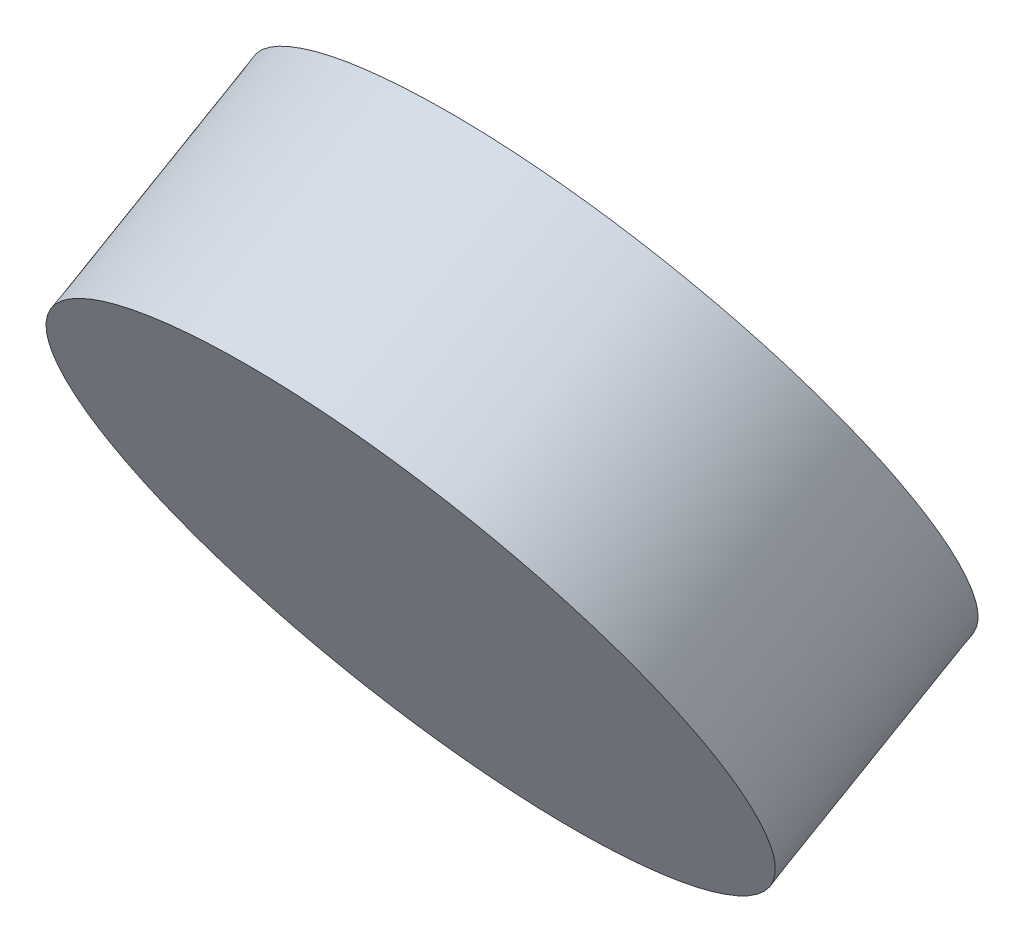
ISO-10303-21;
HEADER;
FILE_DESCRIPTION(('STEP AP214'),'2;1');
FILE_NAME('part.step','',(''),(''),'','','');
FILE_SCHEMA(('AUTOMOTIVE_DESIGN { 1 0 10303 214 1 1 1 1 }'));
ENDSEC;
DATA;
#1=APPLICATION_CONTEXT('core data for automotive mechanical design processes');
#2=APPLICATION_PROTOCOL_DEFINITION('international standard','automotive_design',2000,#1);
#3=PRODUCT_CONTEXT('',#1,'mechanical');
#4=PRODUCT('Part','Part','',(#3));
#5=PRODUCT_RELATED_PRODUCT_CATEGORY('part','',(#4));
#6=PRODUCT_DEFINITION_FORMATION('','',#4);
#7=PRODUCT_DEFINITION_CONTEXT('part definition',#1,'design');
#8=PRODUCT_DEFINITION('design','',#6,#7);
#9=PRODUCT_DEFINITION_SHAPE('','',#8);
#10=(LENGTH_UNIT() NAMED_UNIT(*) SI_UNIT(.MILLI.,.METRE.));
#11=(NAMED_UNIT(*) PLANE_ANGLE_UNIT() SI_UNIT($,.RADIAN.));
#12=(NAMED_UNIT(*) SI_UNIT($,.STERADIAN.) SOLID_ANGLE_UNIT());
#13=UNCERTAINTY_MEASURE_WITH_UNIT(LENGTH_MEASURE(1.E-05),#10,'distance_accuracy_value','');
#14=(GEOMETRIC_REPRESENTATION_CONTEXT(3) GLOBAL_UNCERTAINTY_ASSIGNED_CONTEXT((#13)) GLOBAL_UNIT_ASSIGNED_CONTEXT((#10,
#11,#12)) REPRESENTATION_CONTEXT('',''));
#15=CARTESIAN_POINT('',(0.,0.,0.));
#16=DIRECTION('',(0.,0.,1.));
#17=DIRECTION('',(1.,0.,0.));
#18=AXIS2_PLACEMENT_3D('',#15,#16,#17);
#19=CARTESIAN_POINT('',(12.5,12.8769058027011,-40.1476192479979));
#20=CARTESIAN_POINT('',(12.6682299792076,12.8769058027011,-40.1476192479979));
#21=CARTESIAN_POINT('',(13.0046899376229,12.8189461459482,-40.1810822714263));
#22=CARTESIAN_POINT('',(13.4325454072684,12.5713634390628,-40.3240242138933));
#23=CARTESIAN_POINT('',(13.7184292922025,12.2008297332016,-40.5379519487161));
#24=CARTESIAN_POINT('',(13.8188183624877,11.7637554261858,-40.7902969175275));
#25=CARTESIAN_POINT('',(13.7184292922025,11.32668111917,-41.042641886339));
#26=CARTESIAN_POINT('',(13.4325454072684,10.9561474133088,-41.2565696211617));
#27=CARTESIAN_POINT('',(13.0046899376229,10.7085647064234,-41.3995115636288));
#28=CARTESIAN_POINT('',(12.5,10.621625221294,-41.4497060987714));
#29=CARTESIAN_POINT('',(11.9953100623771,10.7085647064234,-41.3995115636288));
#30=CARTESIAN_POINT('',(11.5674545927316,10.9561474133088,-41.2565696211617));
#31=CARTESIAN_POINT('',(11.2815707077975,11.32668111917,-41.042641886339));
#32=CARTESIAN_POINT('',(11.1811816375123,11.7637554261858,-40.7902969175275));
#33=CARTESIAN_POINT('',(11.2815707077975,12.2008297332016,-40.5379519487161));
#34=CARTESIAN_POINT('',(11.5674545927316,12.5713634390628,-40.3240242138933));
#35=CARTESIAN_POINT('',(11.9953100623771,12.8189461459482,-40.1810822714263));
#36=CARTESIAN_POINT('',(12.3317700207924,12.8769058027011,-40.1476192479979));
#37=CARTESIAN_POINT('',(12.5,12.8769058027011,-40.1476192479979));
#38=B_SPLINE_CURVE_WITH_KNOTS('',3,(#19,#20,#21,#22,#23,#24,#25,#26,#27,#28,#29,#30,#31,#32,#33,
#34,#35,#36,#37),.UNSPECIFIED.,.T.,.F.,(4,1,1,1,1,1,1,1,1,1,1,1,1,1,1,1,4),(0.,
0.0624999999999998,0.124999999999999,0.1875,0.25,0.3125,0.374999999999999,0.4375,
0.499999999999999,0.562499999999999,0.625,0.687499999999999,0.749999999999999,0.812499999999999,
0.874999999999999,0.9375,1.),.UNSPECIFIED.);
#39=DIRECTION('',(0.,0.499999999999995,-0.866025403784442));
#40=VECTOR('',#39,1.);
#41=SURFACE_OF_LINEAR_EXTRUSION('',#38,#40);
#42=CARTESIAN_POINT('',(12.5,12.8769058027011,-40.1476192479979));
#43=CARTESIAN_POINT('',(12.6682299792076,12.8769058027011,-40.1476192479979));
#44=CARTESIAN_POINT('',(13.0046899376229,12.8189461459482,-40.1810822714263));
#45=CARTESIAN_POINT('',(13.4325454072684,12.5713634390628,-40.3240242138933));
#46=CARTESIAN_POINT('',(13.7184292922025,12.2008297332016,-40.5379519487161));
#47=CARTESIAN_POINT('',(13.8188183624877,11.7637554261858,-40.7902969175275));
#48=CARTESIAN_POINT('',(13.7184292922025,11.32668111917,-41.042641886339));
#49=CARTESIAN_POINT('',(13.4325454072684,10.9561474133088,-41.2565696211617));
#50=CARTESIAN_POINT('',(13.0046899376229,10.7085647064234,-41.3995115636288));
#51=CARTESIAN_POINT('',(12.5,10.621625221294,-41.4497060987714));
#52=CARTESIAN_POINT('',(11.9953100623771,10.7085647064234,-41.3995115636288));
#53=CARTESIAN_POINT('',(11.5674545927316,10.9561474133088,-41.2565696211618));
#54=CARTESIAN_POINT('',(11.2815707077975,11.32668111917,-41.042641886339));
#55=CARTESIAN_POINT('',(11.1811816375123,11.7637554261858,-40.7902969175275));
#56=CARTESIAN_POINT('',(11.2815707077975,12.2008297332016,-40.5379519487161));
#57=CARTESIAN_POINT('',(11.5674545927316,12.5713634390628,-40.3240242138933));
#58=CARTESIAN_POINT('',(11.9953100623771,12.8189461459482,-40.1810822714263));
#59=CARTESIAN_POINT('',(12.3317700207924,12.8769058027011,-40.1476192479979));
#60=CARTESIAN_POINT('',(12.5,12.8769058027011,-40.1476192479979));
#61=B_SPLINE_CURVE_WITH_KNOTS('',3,(#42,#43,#44,#45,#46,#47,#48,#49,#50,#51,#52,#53,#54,#55,#56,
#57,#58,#59,#60),.UNSPECIFIED.,.T.,.F.,(4,1,1,1,1,1,1,1,1,1,1,1,1,1,1,1,4),(0.,
0.0624999999999998,0.124999999999999,0.1875,0.25,0.3125,0.374999999999999,0.4375,
0.499999999999999,0.562499999999999,0.625,0.687499999999999,0.749999999999999,0.812499999999999,
0.874999999999999,0.9375,1.),.UNSPECIFIED.);
#62=CARTESIAN_POINT('',(12.5,12.8769058027011,-40.1476192479979));
#63=VERTEX_POINT('',#62);
#64=EDGE_CURVE('E10',#63,#63,#61,.T.);
#65=ORIENTED_EDGE('',*,*,#64,.T.);
#66=EDGE_LOOP('',(#65));
#67=FACE_BOUND('',#66,.T.);
#68=CARTESIAN_POINT('',(12.5,13.3379679238206,-40.9462022672223));
#69=CARTESIAN_POINT('',(12.4802078293791,13.3379679358702,-40.9462022602654));
#70=CARTESIAN_POINT('',(12.4604160064381,13.3375668035859,-40.9464338540977));
#71=CARTESIAN_POINT('',(12.4208740611593,13.3359695558442,-40.9473560255114));
#72=CARTESIAN_POINT('',(12.4011239411206,13.3347733976489,-40.9480466277674));
#73=CARTESIAN_POINT('',(12.361707247751,13.3315933005748,-40.9498826576692));
#74=CARTESIAN_POINT('',(12.3420406800009,13.3296093098847,-40.9510281152282));
#75=CARTESIAN_POINT('',(12.3028326940438,13.3248607327772,-40.9537697074995));
#76=CARTESIAN_POINT('',(12.2832912817157,13.3220961099626,-40.9553658632257));
#77=CARTESIAN_POINT('',(12.2443752838696,13.3157934164188,-40.9590047250398));
#78=CARTESIAN_POINT('',(12.2250007000538,13.3122553378076,-40.9610474356784));
#79=CARTESIAN_POINT('',(12.1864600087902,13.3044129012575,-40.9655752685318));
#80=CARTESIAN_POINT('',(12.1672938951659,13.3001085660865,-40.9680603776014));
#81=CARTESIAN_POINT('',(12.1292118624428,13.2907406613577,-40.9734689399183));
#82=CARTESIAN_POINT('',(12.1102959285924,13.2856771367835,-40.9763923671942));
#83=CARTESIAN_POINT('',(12.0727557510285,13.2747983594353,-40.9826732322247));
#84=CARTESIAN_POINT('',(12.0541314885726,13.2689831551875,-40.9860306419625));
#85=CARTESIAN_POINT('',(12.0172169736989,13.2566068538541,-40.993176102869));
#86=CARTESIAN_POINT('',(11.9989267106994,13.2500457804469,-40.9969641403668));
#87=CARTESIAN_POINT('',(11.9627189991946,13.2361917156669,-41.0049627883969));
#88=CARTESIAN_POINT('',(11.9448015625403,13.2288987010709,-41.0091734123371));
#89=CARTESIAN_POINT('',(11.9093741638814,13.2136025883076,-41.0180046271586));
#90=CARTESIAN_POINT('',(11.8918642282456,13.2055994443496,-41.022625244477));
#91=CARTESIAN_POINT('',(11.8572873025821,13.1889031662712,-41.0322648451201));
#92=CARTESIAN_POINT('',(11.8402203388527,13.1802099913091,-41.0372838520246));
#93=CARTESIAN_POINT('',(11.8065646317142,13.1621541740291,-41.0477083829916));
#94=CARTESIAN_POINT('',(11.7899759025277,13.1527915118294,-41.0531139185329));
#95=CARTESIAN_POINT('',(11.7573120101872,13.1334171061409,-41.0642997368726));
#96=CARTESIAN_POINT('',(11.7412368418012,13.1234053692679,-41.0700800158513));
#97=CARTESIAN_POINT('',(11.7096354069979,13.1027532254237,-41.0820035366591));
#98=CARTESIAN_POINT('',(11.6941091150198,13.0921128477898,-41.0881467615503));
#99=CARTESIAN_POINT('',(11.6636407844299,13.0702238383473,-41.1007843870442));
#100=CARTESIAN_POINT('',(11.6486987074584,13.05897524659,-41.1072787645233));
#101=CARTESIAN_POINT('',(11.6194341116935,13.0358902035123,-41.1206069203585));
#102=CARTESIAN_POINT('',(11.6051115596369,13.0240537838265,-41.1274406804503));
#103=CARTESIAN_POINT('',(11.5771214873967,12.9998136702127,-41.1414357165704));
#104=CARTESIAN_POINT('',(11.5634539672131,12.9874099762847,-41.1485969925987));
#105=CARTESIAN_POINT('',(11.5367976555427,12.9620660929208,-41.1632292904811));
#106=CARTESIAN_POINT('',(11.5238089005846,12.9491258746782,-41.1707003289669));
#107=CARTESIAN_POINT('',(11.4985336495967,12.9227395263764,-41.1859344942618));
#108=CARTESIAN_POINT('',(11.4862471998143,12.9092933630968,-41.1936976402509));
#109=CARTESIAN_POINT('',(11.4624001581987,12.8819257177611,-41.2094983576525));
#110=CARTESIAN_POINT('',(11.4508396002413,12.8680042135687,-41.2175359418455));
#111=CARTESIAN_POINT('',(11.428467963562,12.8397164530154,-41.2338678880158));
#112=CARTESIAN_POINT('',(11.4176568924794,12.8253501921234,-41.242162252609));
#113=CARTESIAN_POINT('',(11.3968078305452,12.7962034947591,-41.2589901061783));
#114=CARTESIAN_POINT('',(11.3867698167363,12.781423070604,-41.2675235880429));
#115=CARTESIAN_POINT('',(11.3674906154502,12.7514785745946,-41.2848120508748));
#116=CARTESIAN_POINT('',(11.3582493808133,12.736314525515,-41.2935670186928));
#117=CARTESIAN_POINT('',(11.3405869511704,12.7056334982872,-41.3112807180219));
#118=CARTESIAN_POINT('',(11.3321657032899,12.6901165429747,-41.3202394363485));
#119=CARTESIAN_POINT('',(11.3161684072298,12.6587597449962,-41.3383432921023));
#120=CARTESIAN_POINT('',(11.3085923322345,12.6429199125933,-41.347488423604));
#121=CARTESIAN_POINT('',(11.2943014104208,12.6109510049536,-41.3659456810356));
#122=CARTESIAN_POINT('',(11.2875865909442,12.5948219205526,-41.3752578122562));
#123=CARTESIAN_POINT('',(11.275024860886,12.5623111730852,-41.3940279010581));
#124=CARTESIAN_POINT('',(11.2691780063378,12.5459294937874,-41.4034858680105));
#125=CARTESIAN_POINT('',(11.2583608816937,12.5129494861501,-41.4225268842977));
#126=CARTESIAN_POINT('',(11.2533906635404,12.4963511450355,-41.4321099410083));
#127=CARTESIAN_POINT('',(11.2443349978722,12.4629739268414,-41.4513802869175));
#128=CARTESIAN_POINT('',(11.2402495766475,12.446195044413,-41.4610675792042));
#129=CARTESIAN_POINT('',(11.2329718528758,12.4124928034574,-41.4805255770923));
#130=CARTESIAN_POINT('',(11.2297795412273,12.3955694464042,-41.4902962818425));
#131=CARTESIAN_POINT('',(11.2242963572203,12.361614327844,-41.5099002786836));
#132=CARTESIAN_POINT('',(11.2220054428337,12.3445825714288,-41.5197335678347));
#133=CARTESIAN_POINT('',(11.2183333810319,12.3104467386035,-41.5394419001054));
#134=CARTESIAN_POINT('',(11.2169521737904,12.2933426670238,-41.5493169404361));
#135=CARTESIAN_POINT('',(11.2151078384199,12.2590982447313,-41.569087966865));
#136=CARTESIAN_POINT('',(11.2146446609407,12.2419578960183,-41.5789839518084));
#137=CARTESIAN_POINT('',(11.2146446609407,12.2076771985922,-41.5987759216954));
#138=CARTESIAN_POINT('',(11.2151078384199,12.1905368498792,-41.6086719066389));
#139=CARTESIAN_POINT('',(11.2169521737904,12.1562924275867,-41.6284429330677));
#140=CARTESIAN_POINT('',(11.2183333810319,12.139188356007,-41.6383179733985));
#141=CARTESIAN_POINT('',(11.2220054428337,12.1050525231818,-41.6580263056691));
#142=CARTESIAN_POINT('',(11.2242963572203,12.0880207667665,-41.6678595948202));
#143=CARTESIAN_POINT('',(11.2297795412273,12.0540656482063,-41.6874635916613));
#144=CARTESIAN_POINT('',(11.2329718528758,12.0371422911531,-41.6972342964116));
#145=CARTESIAN_POINT('',(11.2402495766475,12.0034400501975,-41.7166922942996));
#146=CARTESIAN_POINT('',(11.2443349978722,11.9866611677691,-41.7263795865864));
#147=CARTESIAN_POINT('',(11.2533906635404,11.953283949575,-41.7456499324955));
#148=CARTESIAN_POINT('',(11.2583608816937,11.9366856084604,-41.7552329892061));
#149=CARTESIAN_POINT('',(11.2691780063378,11.9037056008231,-41.7742740054934));
#150=CARTESIAN_POINT('',(11.275024860886,11.8873239215253,-41.7837319724458));
#151=CARTESIAN_POINT('',(11.2875865909442,11.8548131740579,-41.8025020612476));
#152=CARTESIAN_POINT('',(11.2943014104208,11.8386840896569,-41.8118141924683));
#153=CARTESIAN_POINT('',(11.3085923322345,11.8067151820172,-41.8302714498998));
#154=CARTESIAN_POINT('',(11.3161684072298,11.7908753496143,-41.8394165814015));
#155=CARTESIAN_POINT('',(11.3321657032899,11.7595185516358,-41.8575204371553));
#156=CARTESIAN_POINT('',(11.3405869511704,11.7440015963233,-41.866479155482));
#157=CARTESIAN_POINT('',(11.3582493808133,11.7133205690955,-41.884192854811));
#158=CARTESIAN_POINT('',(11.3674906154502,11.6981565200159,-41.8929478226291));
#159=CARTESIAN_POINT('',(11.3867698167363,11.6682120240065,-41.9102362854609));
#160=CARTESIAN_POINT('',(11.3968078305452,11.6534315998514,-41.9187697673256));
#161=CARTESIAN_POINT('',(11.4176568924794,11.6242849024871,-41.9355976208948));
#162=CARTESIAN_POINT('',(11.428467963562,11.6099186415951,-41.9438919854881));
#163=CARTESIAN_POINT('',(11.4508396002413,11.5816308810418,-41.9602239316583));
#164=CARTESIAN_POINT('',(11.4624001581987,11.5677093768494,-41.9682615158513));
#165=CARTESIAN_POINT('',(11.4862471998143,11.5403417315137,-41.984062233253));
#166=CARTESIAN_POINT('',(11.4985336495967,11.5268955682341,-41.991825379242));
#167=CARTESIAN_POINT('',(11.5238089005846,11.5005092199323,-42.007059544537));
#168=CARTESIAN_POINT('',(11.5367976555427,11.4875690016897,-42.0145305830227));
#169=CARTESIAN_POINT('',(11.5634539672131,11.4622251183258,-42.0291628809052));
#170=CARTESIAN_POINT('',(11.5771214873967,11.4498214243978,-42.0363241569335));
#171=CARTESIAN_POINT('',(11.6051115596369,11.425581310784,-42.0503191930535));
#172=CARTESIAN_POINT('',(11.6194341116935,11.4137448910982,-42.0571529531454));
#173=CARTESIAN_POINT('',(11.6486987074584,11.3906598480205,-42.0704811089806));
#174=CARTESIAN_POINT('',(11.6636407844299,11.3794112562632,-42.0769754864596));
#175=CARTESIAN_POINT('',(11.6941091150198,11.3575222468207,-42.0896131119536));
#176=CARTESIAN_POINT('',(11.7096354069979,11.3468818691868,-42.0957563368448));
#177=CARTESIAN_POINT('',(11.7412368418012,11.3262297253426,-42.1076798576525));
#178=CARTESIAN_POINT('',(11.7573120101872,11.3162179884696,-42.1134601366313));
#179=CARTESIAN_POINT('',(11.7899759025277,11.296843582781,-42.1246459549709));
#180=CARTESIAN_POINT('',(11.8065646317142,11.2874809205814,-42.1300514905122));
#181=CARTESIAN_POINT('',(11.8402203388527,11.2694251033013,-42.1404760214793));
#182=CARTESIAN_POINT('',(11.857287302582,11.2607319283393,-42.1454950283838));
#183=CARTESIAN_POINT('',(11.8918642282456,11.2440356502609,-42.1551346290268));
#184=CARTESIAN_POINT('',(11.9093741638818,11.236032506303,-42.1597552463453));
#185=CARTESIAN_POINT('',(11.9448015625399,11.2207363935396,-42.1685864611667));
#186=CARTESIAN_POINT('',(11.9627189991932,11.2134433789435,-42.172797085107));
#187=CARTESIAN_POINT('',(11.9989267107008,11.1995893141637,-42.180795733137));
#188=CARTESIAN_POINT('',(12.0172169737042,11.1930282407567,-42.1845837706347));
#189=CARTESIAN_POINT('',(12.0541314885672,11.1806519394226,-42.1917292315415));
#190=CARTESIAN_POINT('',(12.0727557510086,11.174836735174,-42.1950866412798));
#191=CARTESIAN_POINT('',(12.1102959286123,11.1639579578282,-42.2013675063089));
#192=CARTESIAN_POINT('',(12.1292118625171,11.1588944332572,-42.204290933583));
#193=CARTESIAN_POINT('',(12.1672938950916,11.1495265285195,-42.209699495905));
#194=CARTESIAN_POINT('',(12.1864600085128,11.1452221933364,-42.2121846049817));
#195=CARTESIAN_POINT('',(12.2250007003311,11.1373797568195,-42.2167124378158));
#196=CARTESIAN_POINT('',(12.2443752849046,11.1338416782538,-42.2187551484282));
#197=CARTESIAN_POINT('',(12.2832912806807,11.1275389845858,-42.222394010314));
#198=CARTESIAN_POINT('',(12.3028326901811,11.1247743616014,-42.2239901661382));
#199=CARTESIAN_POINT('',(12.3420406838633,11.1200257849577,-42.2267317581418));
#200=CARTESIAN_POINT('',(12.3617072621656,11.118041794901,-42.227877215335));
#201=CARTESIAN_POINT('',(12.4011239267069,11.1148616960964,-42.229713246236));
#202=CARTESIAN_POINT('',(12.4208740073685,11.1136655355374,-42.2304038498567));
#203=CARTESIAN_POINT('',(12.4604160602261,11.1120682942534,-42.231326017542));
#204=CARTESIAN_POINT('',(12.480208030113,11.1116671707899,-42.2315576062816));
#205=CARTESIAN_POINT('',(12.519791969887,11.1116671707899,-42.2315576062816));
#206=CARTESIAN_POINT('',(12.5395839397739,11.1120682942534,-42.231326017542));
#207=CARTESIAN_POINT('',(12.5791259926315,11.1136655355374,-42.2304038498567));
#208=CARTESIAN_POINT('',(12.5988760732931,11.1148616960964,-42.229713246236));
#209=CARTESIAN_POINT('',(12.6382927378344,11.118041794901,-42.227877215335));
#210=CARTESIAN_POINT('',(12.6579593161366,11.1200257849577,-42.2267317581418));
#211=CARTESIAN_POINT('',(12.6971673098189,11.1247743616014,-42.2239901661382));
#212=CARTESIAN_POINT('',(12.7167087193193,11.1275389845858,-42.222394010314));
#213=CARTESIAN_POINT('',(12.7556247150954,11.1338416782538,-42.2187551484282));
#214=CARTESIAN_POINT('',(12.7749992996689,11.1373797568195,-42.2167124378158));
#215=CARTESIAN_POINT('',(12.8135399914871,11.1452221933364,-42.2121846049817));
#216=CARTESIAN_POINT('',(12.8327061049084,11.1495265285195,-42.209699495905));
#217=CARTESIAN_POINT('',(12.8707881374829,11.1588944332572,-42.204290933583));
#218=CARTESIAN_POINT('',(12.8897040713877,11.1639579578282,-42.2013675063089));
#219=CARTESIAN_POINT('',(12.9272442489914,11.174836735174,-42.1950866412798));
#220=CARTESIAN_POINT('',(12.9458685114327,11.1806519394226,-42.1917292315415));
#221=CARTESIAN_POINT('',(12.9827830262957,11.1930282407567,-42.1845837706347));
#222=CARTESIAN_POINT('',(13.0010732892992,11.1995893141637,-42.180795733137));
#223=CARTESIAN_POINT('',(13.0372810008068,11.2134433789435,-42.172797085107));
#224=CARTESIAN_POINT('',(13.0551984374601,11.2207363935396,-42.1685864611667));
#225=CARTESIAN_POINT('',(13.0906258361182,11.2360325063029,-42.1597552463453));
#226=CARTESIAN_POINT('',(13.1081357717543,11.2440356502609,-42.1551346290268));
#227=CARTESIAN_POINT('',(13.142712697418,11.2607319283393,-42.1454950283838));
#228=CARTESIAN_POINT('',(13.1597796611473,11.2694251033013,-42.1404760214793));
#229=CARTESIAN_POINT('',(13.1934353682858,11.2874809205814,-42.1300514905122));
#230=CARTESIAN_POINT('',(13.2100240974723,11.296843582781,-42.1246459549709));
#231=CARTESIAN_POINT('',(13.2426879898128,11.3162179884696,-42.1134601366313));
#232=CARTESIAN_POINT('',(13.2587631581988,11.3262297253426,-42.1076798576525));
#233=CARTESIAN_POINT('',(13.2903645930021,11.3468818691868,-42.0957563368448));
#234=CARTESIAN_POINT('',(13.3058908849802,11.3575222468207,-42.0896131119536));
#235=CARTESIAN_POINT('',(13.3363592155701,11.3794112562632,-42.0769754864596));
#236=CARTESIAN_POINT('',(13.3513012925416,11.3906598480205,-42.0704811089806));
#237=CARTESIAN_POINT('',(13.3805658883065,11.4137448910982,-42.0571529531454));
#238=CARTESIAN_POINT('',(13.3948884403631,11.425581310784,-42.0503191930535));
#239=CARTESIAN_POINT('',(13.4228785126033,11.4498214243978,-42.0363241569335));
#240=CARTESIAN_POINT('',(13.4365460327869,11.4622251183258,-42.0291628809052));
#241=CARTESIAN_POINT('',(13.4632023444573,11.4875690016897,-42.0145305830227));
#242=CARTESIAN_POINT('',(13.4761910994154,11.5005092199323,-42.007059544537));
#243=CARTESIAN_POINT('',(13.5014663504033,11.5268955682341,-41.991825379242));
#244=CARTESIAN_POINT('',(13.5137528001857,11.5403417315137,-41.984062233253));
#245=CARTESIAN_POINT('',(13.5375998418012,11.5677093768494,-41.9682615158513));
#246=CARTESIAN_POINT('',(13.5491603997587,11.5816308810418,-41.9602239316583));
#247=CARTESIAN_POINT('',(13.571532036438,11.6099186415951,-41.9438919854881));
#248=CARTESIAN_POINT('',(13.5823431075206,11.6242849024871,-41.9355976208948));
#249=CARTESIAN_POINT('',(13.6031921694548,11.6534315998514,-41.9187697673256));
#250=CARTESIAN_POINT('',(13.6132301832637,11.6682120240065,-41.9102362854609));
#251=CARTESIAN_POINT('',(13.6325093845498,11.6981565200159,-41.8929478226291));
#252=CARTESIAN_POINT('',(13.6417506191867,11.7133205690955,-41.884192854811));
#253=CARTESIAN_POINT('',(13.6594130488296,11.7440015963233,-41.866479155482));
#254=CARTESIAN_POINT('',(13.6678342967101,11.7595185516358,-41.8575204371553));
#255=CARTESIAN_POINT('',(13.6838315927701,11.7908753496143,-41.8394165814015));
#256=CARTESIAN_POINT('',(13.6914076677655,11.8067151820172,-41.8302714498998));
#257=CARTESIAN_POINT('',(13.7056985895791,11.8386840896569,-41.8118141924683));
#258=CARTESIAN_POINT('',(13.7124134090558,11.8548131740579,-41.8025020612476));
#259=CARTESIAN_POINT('',(13.724975139114,11.8873239215253,-41.7837319724458));
#260=CARTESIAN_POINT('',(13.7308219936622,11.9037056008231,-41.7742740054934));
#261=CARTESIAN_POINT('',(13.7416391183063,11.9366856084604,-41.7552329892061));
#262=CARTESIAN_POINT('',(13.7466093364596,11.953283949575,-41.7456499324955));
#263=CARTESIAN_POINT('',(13.7556650021278,11.9866611677691,-41.7263795865864));
#264=CARTESIAN_POINT('',(13.7597504233525,12.0034400501975,-41.7166922942996));
#265=CARTESIAN_POINT('',(13.7670281471242,12.0371422911531,-41.6972342964116));
#266=CARTESIAN_POINT('',(13.7702204587727,12.0540656482063,-41.6874635916614));
#267=CARTESIAN_POINT('',(13.7757036427797,12.0880207667665,-41.6678595948202));
#268=CARTESIAN_POINT('',(13.7779945571663,12.1050525231817,-41.6580263056691));
#269=CARTESIAN_POINT('',(13.7816666189681,12.1391883560069,-41.6383179733985));
#270=CARTESIAN_POINT('',(13.7830478262096,12.1562924275867,-41.6284429330677));
#271=CARTESIAN_POINT('',(13.7848921615801,12.1905368498792,-41.6086719066389));
#272=CARTESIAN_POINT('',(13.7853553390593,12.2076771985922,-41.5987759216954));
#273=CARTESIAN_POINT('',(13.7853553390593,12.2419578960183,-41.5789839518084));
#274=CARTESIAN_POINT('',(13.7848921615801,12.2590982447313,-41.569087966865));
#275=CARTESIAN_POINT('',(13.7830478262096,12.2933426670238,-41.5493169404362));
#276=CARTESIAN_POINT('',(13.7816666189681,12.3104467386035,-41.5394419001054));
#277=CARTESIAN_POINT('',(13.7779945571663,12.3445825714287,-41.5197335678347));
#278=CARTESIAN_POINT('',(13.7757036427797,12.361614327844,-41.5099002786836));
#279=CARTESIAN_POINT('',(13.7702204587727,12.3955694464042,-41.4902962818425));
#280=CARTESIAN_POINT('',(13.7670281471242,12.4124928034574,-41.4805255770923));
#281=CARTESIAN_POINT('',(13.7597504233525,12.446195044413,-41.4610675792042));
#282=CARTESIAN_POINT('',(13.7556650021278,12.4629739268414,-41.4513802869175));
#283=CARTESIAN_POINT('',(13.7466093364596,12.4963511450355,-41.4321099410084));
#284=CARTESIAN_POINT('',(13.7416391183063,12.5129494861501,-41.4225268842978));
#285=CARTESIAN_POINT('',(13.7308219936622,12.5459294937874,-41.4034858680105));
#286=CARTESIAN_POINT('',(13.724975139114,12.5623111730852,-41.3940279010581));
#287=CARTESIAN_POINT('',(13.7124134090558,12.5948219205526,-41.3752578122563));
#288=CARTESIAN_POINT('',(13.7056985895791,12.6109510049536,-41.3659456810356));
#289=CARTESIAN_POINT('',(13.6914076677655,12.6429199125933,-41.3474884236041));
#290=CARTESIAN_POINT('',(13.6838315927701,12.6587597449962,-41.3383432921024));
#291=CARTESIAN_POINT('',(13.6678342967101,12.6901165429747,-41.3202394363485));
#292=CARTESIAN_POINT('',(13.6594130488296,12.7056334982871,-41.3112807180219));
#293=CARTESIAN_POINT('',(13.6417506191867,12.736314525515,-41.2935670186928));
#294=CARTESIAN_POINT('',(13.6325093845498,12.7514785745946,-41.2848120508748));
#295=CARTESIAN_POINT('',(13.6132301832637,12.781423070604,-41.2675235880429));
#296=CARTESIAN_POINT('',(13.6031921694548,12.7962034947591,-41.2589901061783));
#297=CARTESIAN_POINT('',(13.5823431075206,12.8253501921234,-41.242162252609));
#298=CARTESIAN_POINT('',(13.571532036438,12.8397164530154,-41.2338678880158));
#299=CARTESIAN_POINT('',(13.5491603997587,12.8680042135687,-41.2175359418455));
#300=CARTESIAN_POINT('',(13.5375998418013,12.8819257177611,-41.2094983576525));
#301=CARTESIAN_POINT('',(13.5137528001857,12.9092933630968,-41.1936976402509));
#302=CARTESIAN_POINT('',(13.5014663504033,12.9227395263764,-41.1859344942618));
#303=CARTESIAN_POINT('',(13.4761910994154,12.9491258746782,-41.1707003289669));
#304=CARTESIAN_POINT('',(13.4632023444573,12.9620660929208,-41.1632292904811));
#305=CARTESIAN_POINT('',(13.4365460327869,12.9874099762847,-41.1485969925987));
#306=CARTESIAN_POINT('',(13.4228785126033,12.9998136702127,-41.1414357165704));
#307=CARTESIAN_POINT('',(13.3948884403631,13.0240537838265,-41.1274406804503));
#308=CARTESIAN_POINT('',(13.3805658883065,13.0358902035123,-41.1206069203585));
#309=CARTESIAN_POINT('',(13.3513012925416,13.05897524659,-41.1072787645233));
#310=CARTESIAN_POINT('',(13.3363592155701,13.0702238383473,-41.1007843870442));
#311=CARTESIAN_POINT('',(13.3058908849802,13.0921128477898,-41.0881467615503));
#312=CARTESIAN_POINT('',(13.2903645930021,13.1027532254237,-41.0820035366591));
#313=CARTESIAN_POINT('',(13.2587631581988,13.1234053692679,-41.0700800158513));
#314=CARTESIAN_POINT('',(13.2426879898128,13.1334171061409,-41.0642997368726));
#315=CARTESIAN_POINT('',(13.2100240974723,13.1527915118294,-41.0531139185329));
#316=CARTESIAN_POINT('',(13.1934353682858,13.1621541740291,-41.0477083829916));
#317=CARTESIAN_POINT('',(13.1597796611473,13.1802099913091,-41.0372838520246));
#318=CARTESIAN_POINT('',(13.1427126974179,13.1889031662712,-41.0322648451201));
#319=CARTESIAN_POINT('',(13.1081357717544,13.2055994443496,-41.022625244477));
#320=CARTESIAN_POINT('',(13.0906258361186,13.2136025883076,-41.0180046271586));
#321=CARTESIAN_POINT('',(13.0551984374597,13.2288987010709,-41.0091734123371));
#322=CARTESIAN_POINT('',(13.0372810008054,13.2361917156669,-41.0049627883969));
#323=CARTESIAN_POINT('',(13.0010732893006,13.2500457804469,-40.9969641403668));
#324=CARTESIAN_POINT('',(12.9827830263011,13.2566068538541,-40.993176102869));
#325=CARTESIAN_POINT('',(12.9458685114274,13.2689831551875,-40.9860306419625));
#326=CARTESIAN_POINT('',(12.9272442489715,13.2747983594353,-40.9826732322247));
#327=CARTESIAN_POINT('',(12.8897040714076,13.2856771367835,-40.9763923671943));
#328=CARTESIAN_POINT('',(12.8707881375572,13.2907406613577,-40.9734689399183));
#329=CARTESIAN_POINT('',(12.8327061048341,13.3001085660865,-40.9680603776014));
#330=CARTESIAN_POINT('',(12.8135399912098,13.3044129012575,-40.9655752685317));
#331=CARTESIAN_POINT('',(12.7749992999462,13.3122553378076,-40.9610474356784));
#332=CARTESIAN_POINT('',(12.7556247161304,13.3157934164188,-40.9590047250398));
#333=CARTESIAN_POINT('',(12.7167087182843,13.3220961099626,-40.9553658632257));
#334=CARTESIAN_POINT('',(12.6971673059562,13.3248607327772,-40.9537697074995));
#335=CARTESIAN_POINT('',(12.6579593199991,13.3296093098847,-40.9510281152282));
#336=CARTESIAN_POINT('',(12.638292752249,13.3315933005748,-40.9498826576692));
#337=CARTESIAN_POINT('',(12.5988760588794,13.3347733976489,-40.9480466277674));
#338=CARTESIAN_POINT('',(12.5791259388407,13.3359695558442,-40.9473560255114));
#339=CARTESIAN_POINT('',(12.5395839935619,13.3375668035859,-40.9464338540977));
#340=CARTESIAN_POINT('',(12.5197921706209,13.3379679358702,-40.9462022602654));
#341=CARTESIAN_POINT('',(12.5,13.3379679238206,-40.9462022672223));
#342=B_SPLINE_CURVE_WITH_KNOTS('',3,(#68,#69,#70,#71,#72,#73,#74,#75,#76,#77,#78,#79,#80,#81,
#82,#83,#84,#85,#86,#87,#88,#89,#90,#91,#92,#93,#94,#95,#96,#97,#98,#99,#100,#101,#102,#103,
#104,#105,#106,#107,#108,#109,#110,#111,#112,#113,#114,#115,#116,#117,#118,#119,#120,#121,#122,
#123,#124,#125,#126,#127,#128,#129,#130,#131,#132,#133,#134,#135,#136,#137,#138,#139,#140,#141,
#142,#143,#144,#145,#146,#147,#148,#149,#150,#151,#152,#153,#154,#155,#156,#157,#158,#159,#160,
#161,#162,#163,#164,#165,#166,#167,#168,#169,#170,#171,#172,#173,#174,#175,#176,#177,#178,#179,
#180,#181,#182,#183,#184,#185,#186,#187,#188,#189,#190,#191,#192,#193,#194,#195,#196,#197,#198,
#199,#200,#201,#202,#203,#204,#205,#206,#207,#208,#209,#210,#211,#212,#213,#214,#215,#216,#217,
#218,#219,#220,#221,#222,#223,#224,#225,#226,#227,#228,#229,#230,#231,#232,#233,#234,#235,#236,
#237,#238,#239,#240,#241,#242,#243,#244,#245,#246,#247,#248,#249,#250,#251,#252,#253,#254,#255,
#256,#257,#258,#259,#260,#261,#262,#263,#264,#265,#266,#267,#268,#269,#270,#271,#272,#273,#274,
#275,#276,#277,#278,#279,#280,#281,#282,#283,#284,#285,#286,#287,#288,#289,#290,#291,#292,#293,
#294,#295,#296,#297,#298,#299,#300,#301,#302,#303,#304,#305,#306,#307,#308,#309,#310,#311,#312,
#313,#314,#315,#316,#317,#318,#319,#320,#321,#322,#323,#324,#325,#326,#327,#328,#329,#330,#331,
#332,#333,#334,#335,#336,#337,#338,#339,#340,#341),.UNSPECIFIED.,.F.,.F.,(4,2,2,2,2,2,2,2,2,2,2,
2,2,2,2,2,2,2,2,2,2,2,2,2,2,2,2,2,2,2,2,2,2,2,2,2,2,2,2,2,2,2,2,2,2,2,2,2,2,2,2,2,2,2,2,2,2,2,2,
2,2,2,2,2,2,2,2,2,2,2,2,2,2,2,2,2,2,2,2,2,2,2,2,2,2,2,2,2,2,2,2,2,2,2,2,2,2,2,2,2,2,2,2,2,2,2,2,
2,2,2,2,2,2,2,2,2,2,2,2,2,2,2,2,2,2,2,2,2,2,2,2,2,2,2,2,2,4),(0.,0.0593705991087859,
0.118744390036232,0.178122086282966,0.237502551496674,0.296883621869475,0.356262928129213,
0.415638717424645,0.475010675504036,0.534380749279064,0.593752707358452,0.653128496653886,
0.712507802913629,0.771888873286427,0.831269338500132,0.890647034746873,0.950020825674319,
1.00939142478311,1.0687620238919,1.12813581481934,1.18751351106608,1.24689397627979,
1.30627504665259,1.36565435291233,1.42503014220776,1.48440210028715,1.54377217406218,
1.60314413214157,1.662519921437,1.72189922769673,1.78128029806953,1.84066076328325,
1.90003845952998,1.95941225045743,2.01878284956622,2.078153448675,2.13752723960245,
2.19690493584919,2.25628540106289,2.3156664714357,2.37504577769544,2.43442156699087,
2.49379352507026,2.55316359884528,2.61253555692468,2.67191134622011,2.73129065247984,
2.79067172285264,2.85005218806635,2.9094298843131,2.96880367524054,3.02817427434932,
3.08754487345811,3.14691866438555,3.2062963606323,3.26567682584601,3.3250578962188,
3.38443720247854,3.44381299177397,3.50318494985336,3.56255502362839,3.62192698170777,
3.68130277100321,3.74068207726295,3.80006314763575,3.85944361284946,3.9188213090962,
3.97819510002364,4.03756569913243,4.09693629824122,4.15631008916867,4.2156877854154,
4.27506825062911,4.33444932100191,4.39382862726165,4.45320441655709,4.51257637463647,
4.5719464484115,4.63131840649089,4.69069419578632,4.75007350204606,4.80945457241886,
4.86883503763257,4.9282127338793,4.98758652480675,5.04695712391554,5.10632772302432,
5.16570151395177,5.22507921019851,5.28445967541222,5.34384074578502,5.40322005204476,
5.46259584134019,5.52196779941958,5.58133787319461,5.64070983127399,5.70008562056943,
5.75946492682917,5.81884599720197,5.87822646241568,5.93760415866241,5.99697794958985,
6.05634854869865,6.11571914780743,6.17509293873488,6.23447063498161,6.29385110019532,
6.35323217056812,6.41261147682786,6.47198726612329,6.53135922420268,6.59072929797771,
6.6501012560571,6.70947704535253,6.76885635161227,6.82823742198507,6.88761788719878,
6.94699558344552,7.00636937437297,7.06573997348175,7.12511057259054,7.18448436351799,
7.24386205976472,7.30324252497843,7.36262359535124,7.42200290161097,7.4813786909064,
7.54075064898579,7.60012072276082,7.65949268084021,7.71886847013564,7.77824777639538,
7.83762884676818,7.8970093119819,7.95638700822863,8.01576079915608,8.07513139826487),.UNSPECIFIED.);
#343=CARTESIAN_POINT('',(12.5,13.3379679238206,-40.9462022672223));
#344=VERTEX_POINT('',#343);
#345=EDGE_CURVE('E25',#344,#344,#342,.F.);
#346=ORIENTED_EDGE('',*,*,#345,.F.);
#347=EDGE_LOOP('',(#346));
#348=FACE_BOUND('',#347,.T.);
#349=ADVANCED_FACE('F15',(#67,#348),#41,.T.);
#350=CARTESIAN_POINT('',(-13.7495895873013,0.969446630382925,-47.0223940065002));
#351=DIRECTION('',(0.,0.499999999999995,-0.866025403784442));
#352=DIRECTION('',(-1.,0.,0.));
#353=AXIS2_PLACEMENT_3D('',#350,#351,#352);
#354=PLANE('',#353);
#355=ORIENTED_EDGE('',*,*,#64,.F.);
#356=EDGE_LOOP('',(#355));
#357=FACE_BOUND('',#356,.T.);
#358=ADVANCED_FACE('F63',(#357),#354,.F.);
#359=CARTESIAN_POINT('',(-13.7495895873013,1.43050875150237,-47.8209770257246));
#360=DIRECTION('',(0.,0.499999999999995,-0.866025403784442));
#361=DIRECTION('',(-1.,0.,0.));
#362=AXIS2_PLACEMENT_3D('',#359,#360,#361);
#363=PLANE('',#362);
#364=ORIENTED_EDGE('',*,*,#345,.T.);
#365=EDGE_LOOP('',(#364));
#366=FACE_BOUND('',#365,.T.);
#367=ADVANCED_FACE('F32',(#366),#363,.T.);
#368=CLOSED_SHELL('',(#349,#358,#367));
#369=MANIFOLD_SOLID_BREP('B1',#368);
#370=ADVANCED_BREP_SHAPE_REPRESENTATION('',(#18,#369),#14);
#371=SHAPE_DEFINITION_REPRESENTATION(#9,#370);
ENDSEC;
END-ISO-10303-21;
